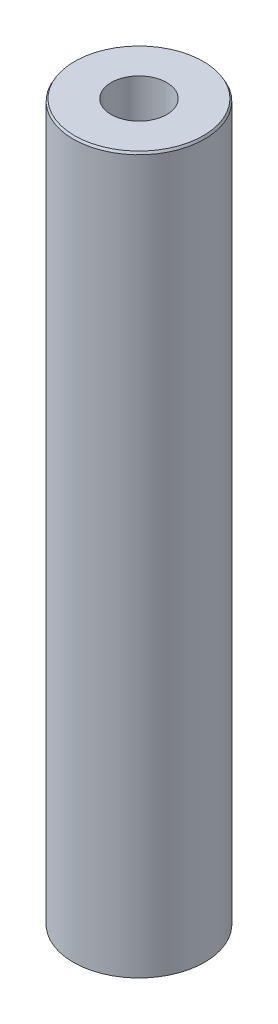
ISO-10303-21;
HEADER;
FILE_DESCRIPTION(('STEP AP214'),'2;1');
FILE_NAME('part.step','',(''),(''),'','','');
FILE_SCHEMA(('AUTOMOTIVE_DESIGN { 1 0 10303 214 1 1 1 1 }'));
ENDSEC;
DATA;
#1=APPLICATION_CONTEXT('core data for automotive mechanical design processes');
#2=APPLICATION_PROTOCOL_DEFINITION('international standard','automotive_design',2000,#1);
#3=PRODUCT_CONTEXT('',#1,'mechanical');
#4=PRODUCT('Part','Part','',(#3));
#5=PRODUCT_RELATED_PRODUCT_CATEGORY('part','',(#4));
#6=PRODUCT_DEFINITION_FORMATION('','',#4);
#7=PRODUCT_DEFINITION_CONTEXT('part definition',#1,'design');
#8=PRODUCT_DEFINITION('design','',#6,#7);
#9=PRODUCT_DEFINITION_SHAPE('','',#8);
#10=(LENGTH_UNIT() NAMED_UNIT(*) SI_UNIT(.MILLI.,.METRE.));
#11=(NAMED_UNIT(*) PLANE_ANGLE_UNIT() SI_UNIT($,.RADIAN.));
#12=(NAMED_UNIT(*) SI_UNIT($,.STERADIAN.) SOLID_ANGLE_UNIT());
#13=UNCERTAINTY_MEASURE_WITH_UNIT(LENGTH_MEASURE(1.E-05),#10,'distance_accuracy_value','');
#14=(GEOMETRIC_REPRESENTATION_CONTEXT(3) GLOBAL_UNCERTAINTY_ASSIGNED_CONTEXT((#13)) GLOBAL_UNIT_ASSIGNED_CONTEXT((#10,
#11,#12)) REPRESENTATION_CONTEXT('',''));
#15=CARTESIAN_POINT('',(0.,0.,0.));
#16=DIRECTION('',(0.,0.,1.));
#17=DIRECTION('',(1.,0.,0.));
#18=AXIS2_PLACEMENT_3D('',#15,#16,#17);
#19=CARTESIAN_POINT('',(0.,600.,0.));
#20=DIRECTION('',(0.,-1.,0.));
#21=DIRECTION('',(0.,0.,-1.));
#22=AXIS2_PLACEMENT_3D('',#19,#20,#21);
#23=CYLINDRICAL_SURFACE('',#22,55.);
#24=CARTESIAN_POINT('',(0.,598.083071363479,0.));
#25=DIRECTION('',(0.,1.,0.));
#26=DIRECTION('',(0.,0.,1.));
#27=AXIS2_PLACEMENT_3D('',#24,#25,#26);
#28=CIRCLE('',#27,55.);
#29=CARTESIAN_POINT('',(0.,598.083071363479,55.));
#30=VERTEX_POINT('',#29);
#31=EDGE_CURVE('E50',#30,#30,#28,.F.);
#32=ORIENTED_EDGE('',*,*,#31,.T.);
#33=EDGE_LOOP('',(#32));
#34=FACE_BOUND('',#33,.T.);
#35=CARTESIAN_POINT('',(0.,1.10673926431237,0.));
#36=DIRECTION('',(0.,1.,0.));
#37=DIRECTION('',(0.,0.,1.));
#38=AXIS2_PLACEMENT_3D('',#35,#36,#37);
#39=CIRCLE('',#38,55.);
#40=CARTESIAN_POINT('',(0.,1.10673926431237,55.));
#41=VERTEX_POINT('',#40);
#42=EDGE_CURVE('E51',#41,#41,#39,.T.);
#43=ORIENTED_EDGE('',*,*,#42,.T.);
#44=EDGE_LOOP('',(#43));
#45=FACE_BOUND('',#44,.T.);
#46=ADVANCED_FACE('F39',(#34,#45),#23,.T.);
#47=CARTESIAN_POINT('',(0.,600.,0.));
#48=DIRECTION('',(0.,1.,0.));
#49=DIRECTION('',(0.,0.,1.));
#50=AXIS2_PLACEMENT_3D('',#47,#48,#49);
#51=PLANE('',#50);
#52=CARTESIAN_POINT('',(0.,600.,0.));
#53=DIRECTION('',(0.,1.,0.));
#54=DIRECTION('',(0.,0.,1.));
#55=AXIS2_PLACEMENT_3D('',#52,#53,#54);
#56=CIRCLE('',#55,53.8932607356875);
#57=CARTESIAN_POINT('',(0.,600.,53.8932607356875));
#58=VERTEX_POINT('',#57);
#59=EDGE_CURVE('E54',#58,#58,#56,.T.);
#60=ORIENTED_EDGE('',*,*,#59,.T.);
#61=EDGE_LOOP('',(#60));
#62=FACE_BOUND('',#61,.T.);
#63=CARTESIAN_POINT('',(0.,600.,0.));
#64=DIRECTION('',(0.,1.,0.));
#65=DIRECTION('',(0.,0.,1.));
#66=AXIS2_PLACEMENT_3D('',#63,#64,#65);
#67=CIRCLE('',#66,23.2508971104375);
#68=CARTESIAN_POINT('',(0.,600.,23.2508971104375));
#69=VERTEX_POINT('',#68);
#70=EDGE_CURVE('E58',#69,#69,#67,.T.);
#71=ORIENTED_EDGE('',*,*,#70,.F.);
#72=EDGE_LOOP('',(#71));
#73=FACE_BOUND('',#72,.T.);
#74=ADVANCED_FACE('F69',(#62,#73),#51,.T.);
#75=CARTESIAN_POINT('',(0.,0.,0.));
#76=DIRECTION('',(0.,1.,0.));
#77=DIRECTION('',(0.,0.,1.));
#78=AXIS2_PLACEMENT_3D('',#75,#76,#77);
#79=PLANE('',#78);
#80=CARTESIAN_POINT('',(0.,0.,0.));
#81=DIRECTION('',(0.,1.,0.));
#82=DIRECTION('',(0.,0.,1.));
#83=AXIS2_PLACEMENT_3D('',#80,#81,#82);
#84=CIRCLE('',#83,53.0830713634795);
#85=CARTESIAN_POINT('',(0.,0.,53.0830713634795));
#86=VERTEX_POINT('',#85);
#87=EDGE_CURVE('E10',#86,#86,#84,.F.);
#88=ORIENTED_EDGE('',*,*,#87,.T.);
#89=EDGE_LOOP('',(#88));
#90=FACE_BOUND('',#89,.T.);
#91=CARTESIAN_POINT('',(0.,0.,0.));
#92=DIRECTION('',(0.,1.,0.));
#93=DIRECTION('',(0.,0.,1.));
#94=AXIS2_PLACEMENT_3D('',#91,#92,#93);
#95=CIRCLE('',#94,23.2508971104375);
#96=CARTESIAN_POINT('',(0.,0.,23.2508971104375));
#97=VERTEX_POINT('',#96);
#98=EDGE_CURVE('E63',#97,#97,#95,.T.);
#99=ORIENTED_EDGE('',*,*,#98,.T.);
#100=EDGE_LOOP('',(#99));
#101=FACE_BOUND('',#100,.T.);
#102=ADVANCED_FACE('F75',(#90,#101),#79,.F.);
#103=CARTESIAN_POINT('',(0.,600.,0.));
#104=DIRECTION('',(0.,-1.,0.));
#105=DIRECTION('',(0.,0.,-1.));
#106=AXIS2_PLACEMENT_3D('',#103,#104,#105);
#107=CYLINDRICAL_SURFACE('',#106,23.2508971104375);
#108=ORIENTED_EDGE('',*,*,#70,.T.);
#109=EDGE_LOOP('',(#108));
#110=FACE_BOUND('',#109,.T.);
#111=ORIENTED_EDGE('',*,*,#98,.F.);
#112=EDGE_LOOP('',(#111));
#113=FACE_BOUND('',#112,.T.);
#114=ADVANCED_FACE('F70',(#110,#113),#107,.F.);
#115=CARTESIAN_POINT('',(0.,600.,0.));
#116=DIRECTION('',(0.,-1.,0.));
#117=DIRECTION('',(0.,0.,-1.));
#118=AXIS2_PLACEMENT_3D('',#115,#116,#117);
#119=CONICAL_SURFACE('',#118,53.8932607356875,0.523598775598332);
#120=ORIENTED_EDGE('',*,*,#31,.F.);
#121=EDGE_LOOP('',(#120));
#122=FACE_BOUND('',#121,.T.);
#123=ORIENTED_EDGE('',*,*,#59,.F.);
#124=EDGE_LOOP('',(#123));
#125=FACE_BOUND('',#124,.T.);
#126=ADVANCED_FACE('F81',(#122,#125),#119,.T.);
#127=CARTESIAN_POINT('',(0.,1.10673926431237,0.));
#128=DIRECTION('',(0.,1.,0.));
#129=DIRECTION('',(0.,0.,1.));
#130=AXIS2_PLACEMENT_3D('',#127,#128,#129);
#131=CONICAL_SURFACE('',#130,55.,1.04719755119661);
#132=ORIENTED_EDGE('',*,*,#87,.F.);
#133=EDGE_LOOP('',(#132));
#134=FACE_BOUND('',#133,.T.);
#135=ORIENTED_EDGE('',*,*,#42,.F.);
#136=EDGE_LOOP('',(#135));
#137=FACE_BOUND('',#136,.T.);
#138=ADVANCED_FACE('F45',(#134,#137),#131,.T.);
#139=CLOSED_SHELL('',(#46,#74,#102,#114,#126,#138));
#140=MANIFOLD_SOLID_BREP('B2',#139);
#141=ADVANCED_BREP_SHAPE_REPRESENTATION('',(#18,#140),#14);
#142=SHAPE_DEFINITION_REPRESENTATION(#9,#141);
ENDSEC;
END-ISO-10303-21;
